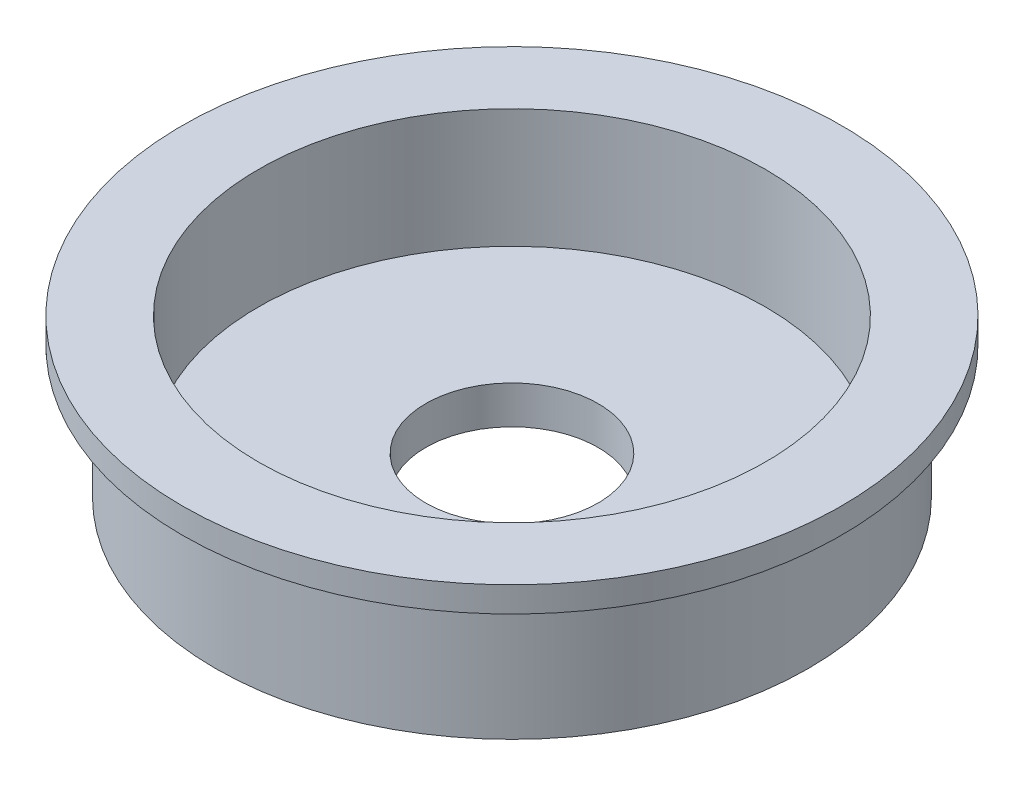
ISO-10303-21;
HEADER;
FILE_DESCRIPTION(('STEP AP214'),'2;1');
FILE_NAME('part.step','',(''),(''),'','','');
FILE_SCHEMA(('AUTOMOTIVE_DESIGN { 1 0 10303 214 1 1 1 1 }'));
ENDSEC;
DATA;
#1=APPLICATION_CONTEXT('core data for automotive mechanical design processes');
#2=APPLICATION_PROTOCOL_DEFINITION('international standard','automotive_design',2000,#1);
#3=PRODUCT_CONTEXT('',#1,'mechanical');
#4=PRODUCT('Part','Part','',(#3));
#5=PRODUCT_RELATED_PRODUCT_CATEGORY('part','',(#4));
#6=PRODUCT_DEFINITION_FORMATION('','',#4);
#7=PRODUCT_DEFINITION_CONTEXT('part definition',#1,'design');
#8=PRODUCT_DEFINITION('design','',#6,#7);
#9=PRODUCT_DEFINITION_SHAPE('','',#8);
#10=(LENGTH_UNIT() NAMED_UNIT(*) SI_UNIT(.MILLI.,.METRE.));
#11=(NAMED_UNIT(*) PLANE_ANGLE_UNIT() SI_UNIT($,.RADIAN.));
#12=(NAMED_UNIT(*) SI_UNIT($,.STERADIAN.) SOLID_ANGLE_UNIT());
#13=UNCERTAINTY_MEASURE_WITH_UNIT(LENGTH_MEASURE(1.E-05),#10,'distance_accuracy_value','');
#14=(GEOMETRIC_REPRESENTATION_CONTEXT(3) GLOBAL_UNCERTAINTY_ASSIGNED_CONTEXT((#13)) GLOBAL_UNIT_ASSIGNED_CONTEXT((#10,
#11,#12)) REPRESENTATION_CONTEXT('',''));
#15=CARTESIAN_POINT('',(0.,0.,0.));
#16=DIRECTION('',(0.,0.,1.));
#17=DIRECTION('',(1.,0.,0.));
#18=AXIS2_PLACEMENT_3D('',#15,#16,#17);
#19=CARTESIAN_POINT('',(0.,6.604,0.));
#20=DIRECTION('',(0.,-1.,0.));
#21=DIRECTION('',(0.,0.,-1.));
#22=AXIS2_PLACEMENT_3D('',#19,#20,#21);
#23=CYLINDRICAL_SURFACE('',#22,4.318);
#24=CARTESIAN_POINT('',(0.,0.,0.));
#25=DIRECTION('',(0.,1.,0.));
#26=DIRECTION('',(0.,0.,1.));
#27=AXIS2_PLACEMENT_3D('',#24,#25,#26);
#28=CIRCLE('',#27,4.318);
#29=CARTESIAN_POINT('',(0.,0.,4.318));
#30=VERTEX_POINT('',#29);
#31=EDGE_CURVE('E52',#30,#30,#28,.T.);
#32=ORIENTED_EDGE('',*,*,#31,.F.);
#33=EDGE_LOOP('',(#32));
#34=FACE_BOUND('',#33,.T.);
#35=CARTESIAN_POINT('',(0.,1.905,0.));
#36=DIRECTION('',(0.,1.,0.));
#37=DIRECTION('',(0.,0.,1.));
#38=AXIS2_PLACEMENT_3D('',#35,#36,#37);
#39=CIRCLE('',#38,4.318);
#40=CARTESIAN_POINT('',(0.,1.905,4.318));
#41=VERTEX_POINT('',#40);
#42=EDGE_CURVE('E41',#41,#41,#39,.T.);
#43=ORIENTED_EDGE('',*,*,#42,.T.);
#44=EDGE_LOOP('',(#43));
#45=FACE_BOUND('',#44,.T.);
#46=ADVANCED_FACE('F37',(#34,#45),#23,.F.);
#47=CARTESIAN_POINT('',(0.,0.,0.));
#48=DIRECTION('',(0.,1.,0.));
#49=DIRECTION('',(0.,0.,1.));
#50=AXIS2_PLACEMENT_3D('',#47,#48,#49);
#51=PLANE('',#50);
#52=CARTESIAN_POINT('',(0.,0.,0.));
#53=DIRECTION('',(0.,1.,0.));
#54=DIRECTION('',(0.,0.,1.));
#55=AXIS2_PLACEMENT_3D('',#52,#53,#54);
#56=CIRCLE('',#55,14.859);
#57=CARTESIAN_POINT('',(0.,0.,14.859));
#58=VERTEX_POINT('',#57);
#59=EDGE_CURVE('E46',#58,#58,#56,.T.);
#60=ORIENTED_EDGE('',*,*,#59,.F.);
#61=EDGE_LOOP('',(#60));
#62=FACE_BOUND('',#61,.T.);
#63=ORIENTED_EDGE('',*,*,#31,.T.);
#64=EDGE_LOOP('',(#63));
#65=FACE_BOUND('',#64,.T.);
#66=ADVANCED_FACE('F90',(#62,#65),#51,.F.);
#67=CARTESIAN_POINT('',(0.,6.604,0.));
#68=DIRECTION('',(0.,-1.,0.));
#69=DIRECTION('',(0.,0.,-1.));
#70=AXIS2_PLACEMENT_3D('',#67,#68,#69);
#71=CYLINDRICAL_SURFACE('',#70,14.859);
#72=CARTESIAN_POINT('',(0.,6.604,0.));
#73=DIRECTION('',(0.,1.,0.));
#74=DIRECTION('',(0.,0.,1.));
#75=AXIS2_PLACEMENT_3D('',#72,#73,#74);
#76=CIRCLE('',#75,14.859);
#77=CARTESIAN_POINT('',(0.,6.604,14.859));
#78=VERTEX_POINT('',#77);
#79=EDGE_CURVE('E10',#78,#78,#76,.T.);
#80=ORIENTED_EDGE('',*,*,#79,.F.);
#81=EDGE_LOOP('',(#80));
#82=FACE_BOUND('',#81,.T.);
#83=ORIENTED_EDGE('',*,*,#59,.T.);
#84=EDGE_LOOP('',(#83));
#85=FACE_BOUND('',#84,.T.);
#86=ADVANCED_FACE('F39',(#82,#85),#71,.T.);
#87=CARTESIAN_POINT('',(0.,7.874,0.));
#88=DIRECTION('',(0.,1.,0.));
#89=DIRECTION('',(0.,0.,1.));
#90=AXIS2_PLACEMENT_3D('',#87,#88,#89);
#91=PLANE('',#90);
#92=CARTESIAN_POINT('',(0.,7.874,0.));
#93=DIRECTION('',(0.,1.,0.));
#94=DIRECTION('',(0.,0.,1.));
#95=AXIS2_PLACEMENT_3D('',#92,#93,#94);
#96=CIRCLE('',#95,12.7);
#97=CARTESIAN_POINT('',(0.,7.874,12.7));
#98=VERTEX_POINT('',#97);
#99=EDGE_CURVE('E65',#98,#98,#96,.T.);
#100=ORIENTED_EDGE('',*,*,#99,.F.);
#101=EDGE_LOOP('',(#100));
#102=FACE_BOUND('',#101,.T.);
#103=CARTESIAN_POINT('',(0.,7.874,0.));
#104=DIRECTION('',(0.,1.,0.));
#105=DIRECTION('',(0.,0.,1.));
#106=AXIS2_PLACEMENT_3D('',#103,#104,#105);
#107=CIRCLE('',#106,16.51);
#108=CARTESIAN_POINT('',(0.,7.874,16.51));
#109=VERTEX_POINT('',#108);
#110=EDGE_CURVE('E57',#109,#109,#107,.T.);
#111=ORIENTED_EDGE('',*,*,#110,.T.);
#112=EDGE_LOOP('',(#111));
#113=FACE_BOUND('',#112,.T.);
#114=ADVANCED_FACE('F105',(#102,#113),#91,.T.);
#115=CARTESIAN_POINT('',(0.,6.604,0.));
#116=DIRECTION('',(0.,1.,0.));
#117=DIRECTION('',(0.,0.,1.));
#118=AXIS2_PLACEMENT_3D('',#115,#116,#117);
#119=PLANE('',#118);
#120=ORIENTED_EDGE('',*,*,#79,.T.);
#121=EDGE_LOOP('',(#120));
#122=FACE_BOUND('',#121,.T.);
#123=CARTESIAN_POINT('',(0.,6.604,0.));
#124=DIRECTION('',(0.,1.,0.));
#125=DIRECTION('',(0.,0.,1.));
#126=AXIS2_PLACEMENT_3D('',#123,#124,#125);
#127=CIRCLE('',#126,16.51);
#128=CARTESIAN_POINT('',(0.,6.604,16.51));
#129=VERTEX_POINT('',#128);
#130=EDGE_CURVE('E58',#129,#129,#127,.T.);
#131=ORIENTED_EDGE('',*,*,#130,.F.);
#132=EDGE_LOOP('',(#131));
#133=FACE_BOUND('',#132,.T.);
#134=ADVANCED_FACE('F101',(#122,#133),#119,.F.);
#135=CARTESIAN_POINT('',(0.,7.874,0.));
#136=DIRECTION('',(0.,-1.,0.));
#137=DIRECTION('',(0.,0.,-1.));
#138=AXIS2_PLACEMENT_3D('',#135,#136,#137);
#139=CYLINDRICAL_SURFACE('',#138,16.51);
#140=ORIENTED_EDGE('',*,*,#110,.F.);
#141=EDGE_LOOP('',(#140));
#142=FACE_BOUND('',#141,.T.);
#143=ORIENTED_EDGE('',*,*,#130,.T.);
#144=EDGE_LOOP('',(#143));
#145=FACE_BOUND('',#144,.T.);
#146=ADVANCED_FACE('F86',(#142,#145),#139,.T.);
#147=CARTESIAN_POINT('',(0.,1.905,0.));
#148=DIRECTION('',(0.,1.,0.));
#149=DIRECTION('',(0.,0.,1.));
#150=AXIS2_PLACEMENT_3D('',#147,#148,#149);
#151=CYLINDRICAL_SURFACE('',#150,12.7);
#152=CARTESIAN_POINT('',(0.,1.905,0.));
#153=DIRECTION('',(0.,1.,0.));
#154=DIRECTION('',(0.,0.,1.));
#155=AXIS2_PLACEMENT_3D('',#152,#153,#154);
#156=CIRCLE('',#155,12.7);
#157=CARTESIAN_POINT('',(0.,1.905,12.7));
#158=VERTEX_POINT('',#157);
#159=EDGE_CURVE('E69',#158,#158,#156,.T.);
#160=ORIENTED_EDGE('',*,*,#159,.F.);
#161=EDGE_LOOP('',(#160));
#162=FACE_BOUND('',#161,.T.);
#163=ORIENTED_EDGE('',*,*,#99,.T.);
#164=EDGE_LOOP('',(#163));
#165=FACE_BOUND('',#164,.T.);
#166=ADVANCED_FACE('F81',(#162,#165),#151,.F.);
#167=CARTESIAN_POINT('',(0.,1.905,0.));
#168=DIRECTION('',(0.,1.,0.));
#169=DIRECTION('',(0.,0.,1.));
#170=AXIS2_PLACEMENT_3D('',#167,#168,#169);
#171=PLANE('',#170);
#172=ORIENTED_EDGE('',*,*,#42,.F.);
#173=EDGE_LOOP('',(#172));
#174=FACE_BOUND('',#173,.T.);
#175=ORIENTED_EDGE('',*,*,#159,.T.);
#176=EDGE_LOOP('',(#175));
#177=FACE_BOUND('',#176,.T.);
#178=ADVANCED_FACE('F79',(#174,#177),#171,.T.);
#179=CLOSED_SHELL('',(#46,#66,#86,#114,#134,#146,#166,#178));
#180=MANIFOLD_SOLID_BREP('B2',#179);
#181=ADVANCED_BREP_SHAPE_REPRESENTATION('',(#18,#180),#14);
#182=SHAPE_DEFINITION_REPRESENTATION(#9,#181);
ENDSEC;
END-ISO-10303-21;
